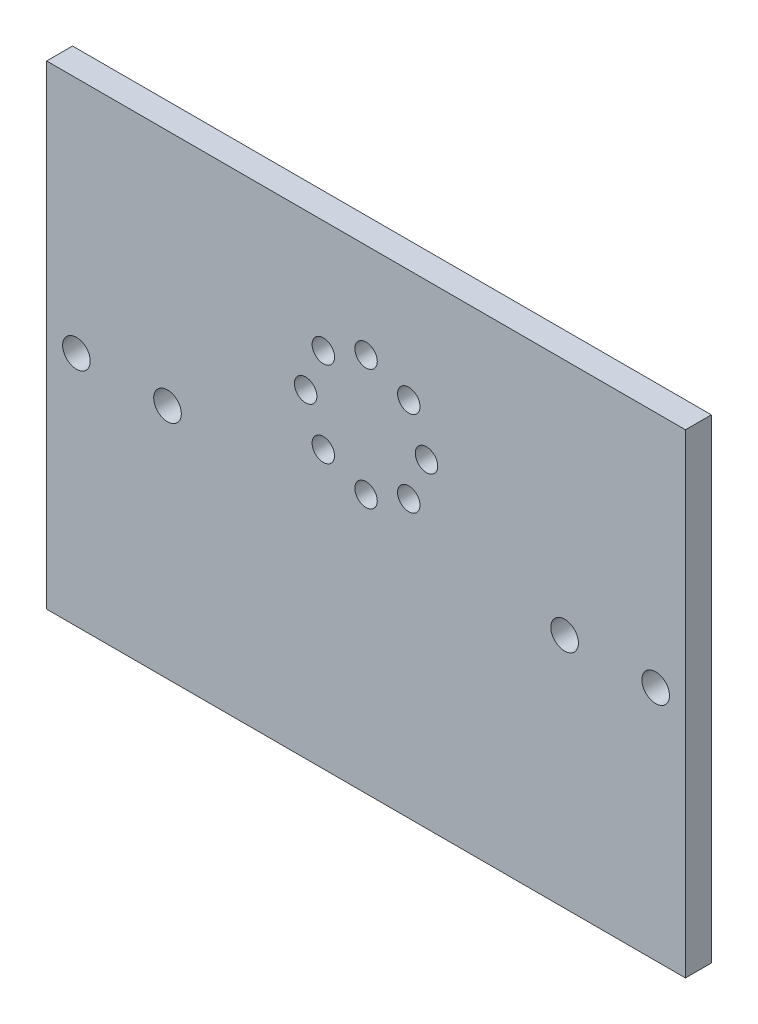
ISO-10303-21;
HEADER;
FILE_DESCRIPTION(('STEP AP214'),'2;1');
FILE_NAME('part.step','',(''),(''),'','','');
FILE_SCHEMA(('AUTOMOTIVE_DESIGN { 1 0 10303 214 1 1 1 1 }'));
ENDSEC;
DATA;
#1=APPLICATION_CONTEXT('core data for automotive mechanical design processes');
#2=APPLICATION_PROTOCOL_DEFINITION('international standard','automotive_design',2000,#1);
#3=PRODUCT_CONTEXT('',#1,'mechanical');
#4=PRODUCT('Part','Part','',(#3));
#5=PRODUCT_RELATED_PRODUCT_CATEGORY('part','',(#4));
#6=PRODUCT_DEFINITION_FORMATION('','',#4);
#7=PRODUCT_DEFINITION_CONTEXT('part definition',#1,'design');
#8=PRODUCT_DEFINITION('design','',#6,#7);
#9=PRODUCT_DEFINITION_SHAPE('','',#8);
#10=(LENGTH_UNIT() NAMED_UNIT(*) SI_UNIT(.MILLI.,.METRE.));
#11=(NAMED_UNIT(*) PLANE_ANGLE_UNIT() SI_UNIT($,.RADIAN.));
#12=(NAMED_UNIT(*) SI_UNIT($,.STERADIAN.) SOLID_ANGLE_UNIT());
#13=UNCERTAINTY_MEASURE_WITH_UNIT(LENGTH_MEASURE(1.E-05),#10,'distance_accuracy_value','');
#14=(GEOMETRIC_REPRESENTATION_CONTEXT(3) GLOBAL_UNCERTAINTY_ASSIGNED_CONTEXT((#13)) GLOBAL_UNIT_ASSIGNED_CONTEXT((#10,
#11,#12)) REPRESENTATION_CONTEXT('',''));
#15=CARTESIAN_POINT('',(0.,0.,0.));
#16=DIRECTION('',(0.,0.,1.));
#17=DIRECTION('',(1.,0.,0.));
#18=AXIS2_PLACEMENT_3D('',#15,#16,#17);
#19=CARTESIAN_POINT('',(37.,27.5,3.));
#20=DIRECTION('',(-1.,0.,0.));
#21=DIRECTION('',(0.,-1.,0.));
#22=AXIS2_PLACEMENT_3D('',#19,#20,#21);
#23=PLANE('',#22);
#24=DIRECTION('',(0.,1.,0.));
#25=VECTOR('',#24,1.);
#26=CARTESIAN_POINT('',(37.,27.5,0.));
#27=LINE('',#26,#25);
#28=CARTESIAN_POINT('',(37.,-27.5,0.));
#29=VERTEX_POINT('',#28);
#30=CARTESIAN_POINT('',(37.,27.5,0.));
#31=VERTEX_POINT('',#30);
#32=EDGE_CURVE('E97',#29,#31,#27,.T.);
#33=ORIENTED_EDGE('',*,*,#32,.T.);
#34=DIRECTION('',(0.,0.,-1.));
#35=VECTOR('',#34,1.);
#36=CARTESIAN_POINT('',(37.,27.5,3.));
#37=LINE('',#36,#35);
#38=CARTESIAN_POINT('',(37.,27.5,3.));
#39=VERTEX_POINT('',#38);
#40=EDGE_CURVE('E11',#39,#31,#37,.T.);
#41=ORIENTED_EDGE('',*,*,#40,.F.);
#42=DIRECTION('',(0.,1.,0.));
#43=VECTOR('',#42,1.);
#44=CARTESIAN_POINT('',(37.,27.5,3.));
#45=LINE('',#44,#43);
#46=CARTESIAN_POINT('',(37.,-27.5,3.));
#47=VERTEX_POINT('',#46);
#48=EDGE_CURVE('E85',#47,#39,#45,.T.);
#49=ORIENTED_EDGE('',*,*,#48,.F.);
#50=DIRECTION('',(0.,0.,-1.));
#51=VECTOR('',#50,1.);
#52=CARTESIAN_POINT('',(37.,-27.5,3.));
#53=LINE('',#52,#51);
#54=EDGE_CURVE('E93',#47,#29,#53,.T.);
#55=ORIENTED_EDGE('',*,*,#54,.T.);
#56=EDGE_LOOP('',(#33,#41,#49,#55));
#57=FACE_BOUND('',#56,.T.);
#58=ADVANCED_FACE('F34',(#57),#23,.F.);
#59=CARTESIAN_POINT('',(-37.,27.5,3.));
#60=DIRECTION('',(0.,-1.,0.));
#61=DIRECTION('',(0.,0.,-1.));
#62=AXIS2_PLACEMENT_3D('',#59,#60,#61);
#63=PLANE('',#62);
#64=DIRECTION('',(-1.,0.,0.));
#65=VECTOR('',#64,1.);
#66=CARTESIAN_POINT('',(-37.,27.5,0.));
#67=LINE('',#66,#65);
#68=CARTESIAN_POINT('',(-37.,27.5,0.));
#69=VERTEX_POINT('',#68);
#70=EDGE_CURVE('E89',#31,#69,#67,.T.);
#71=ORIENTED_EDGE('',*,*,#70,.T.);
#72=DIRECTION('',(0.,0.,-1.));
#73=VECTOR('',#72,1.);
#74=CARTESIAN_POINT('',(-37.,27.5,3.));
#75=LINE('',#74,#73);
#76=CARTESIAN_POINT('',(-37.,27.5,3.));
#77=VERTEX_POINT('',#76);
#78=EDGE_CURVE('E42',#77,#69,#75,.T.);
#79=ORIENTED_EDGE('',*,*,#78,.F.);
#80=DIRECTION('',(-1.,0.,0.));
#81=VECTOR('',#80,1.);
#82=CARTESIAN_POINT('',(-37.,27.5,3.));
#83=LINE('',#82,#81);
#84=EDGE_CURVE('E80',#39,#77,#83,.T.);
#85=ORIENTED_EDGE('',*,*,#84,.F.);
#86=ORIENTED_EDGE('',*,*,#40,.T.);
#87=EDGE_LOOP('',(#71,#79,#85,#86));
#88=FACE_BOUND('',#87,.T.);
#89=ADVANCED_FACE('F88',(#88),#63,.F.);
#90=CARTESIAN_POINT('',(-37.,27.5,3.));
#91=DIRECTION('',(1.,0.,0.));
#92=DIRECTION('',(0.,1.,0.));
#93=AXIS2_PLACEMENT_3D('',#90,#91,#92);
#94=PLANE('',#93);
#95=DIRECTION('',(0.,-1.,0.));
#96=VECTOR('',#95,1.);
#97=CARTESIAN_POINT('',(-37.,27.5,0.));
#98=LINE('',#97,#96);
#99=CARTESIAN_POINT('',(-37.,-27.5,0.));
#100=VERTEX_POINT('',#99);
#101=EDGE_CURVE('E67',#69,#100,#98,.T.);
#102=ORIENTED_EDGE('',*,*,#101,.T.);
#103=DIRECTION('',(0.,0.,-1.));
#104=VECTOR('',#103,1.);
#105=CARTESIAN_POINT('',(-37.,-27.5,3.));
#106=LINE('',#105,#104);
#107=CARTESIAN_POINT('',(-37.,-27.5,3.));
#108=VERTEX_POINT('',#107);
#109=EDGE_CURVE('E90',#108,#100,#106,.T.);
#110=ORIENTED_EDGE('',*,*,#109,.F.);
#111=DIRECTION('',(0.,-1.,0.));
#112=VECTOR('',#111,1.);
#113=CARTESIAN_POINT('',(-37.,27.5,3.));
#114=LINE('',#113,#112);
#115=EDGE_CURVE('E83',#77,#108,#114,.T.);
#116=ORIENTED_EDGE('',*,*,#115,.F.);
#117=ORIENTED_EDGE('',*,*,#78,.T.);
#118=EDGE_LOOP('',(#102,#110,#116,#117));
#119=FACE_BOUND('',#118,.T.);
#120=ADVANCED_FACE('F91',(#119),#94,.F.);
#121=CARTESIAN_POINT('',(-37.,-27.5,3.));
#122=DIRECTION('',(0.,1.,0.));
#123=DIRECTION('',(0.,0.,1.));
#124=AXIS2_PLACEMENT_3D('',#121,#122,#123);
#125=PLANE('',#124);
#126=DIRECTION('',(1.,0.,0.));
#127=VECTOR('',#126,1.);
#128=CARTESIAN_POINT('',(-37.,-27.5,0.));
#129=LINE('',#128,#127);
#130=EDGE_CURVE('E73',#100,#29,#129,.T.);
#131=ORIENTED_EDGE('',*,*,#130,.T.);
#132=ORIENTED_EDGE('',*,*,#54,.F.);
#133=DIRECTION('',(1.,0.,0.));
#134=VECTOR('',#133,1.);
#135=CARTESIAN_POINT('',(-37.,-27.5,3.));
#136=LINE('',#135,#134);
#137=EDGE_CURVE('E50',#108,#47,#136,.T.);
#138=ORIENTED_EDGE('',*,*,#137,.F.);
#139=ORIENTED_EDGE('',*,*,#109,.T.);
#140=EDGE_LOOP('',(#131,#132,#138,#139));
#141=FACE_BOUND('',#140,.T.);
#142=ADVANCED_FACE('F105',(#141),#125,.F.);
#143=CARTESIAN_POINT('',(0.,0.,3.));
#144=DIRECTION('',(0.,0.,1.));
#145=DIRECTION('',(1.,0.,0.));
#146=AXIS2_PLACEMENT_3D('',#143,#144,#145);
#147=PLANE('',#146);
#148=CARTESIAN_POINT('',(4.94974746830583,4.55025253169417,3.));
#149=DIRECTION('',(0.,0.,1.));
#150=DIRECTION('',(1.,0.,0.));
#151=AXIS2_PLACEMENT_3D('',#148,#149,#150);
#152=CIRCLE('',#151,1.3);
#153=CARTESIAN_POINT('',(6.24974746830583,4.55025253169417,3.));
#154=VERTEX_POINT('',#153);
#155=EDGE_CURVE('E138',#154,#154,#152,.T.);
#156=ORIENTED_EDGE('',*,*,#155,.F.);
#157=EDGE_LOOP('',(#156));
#158=FACE_BOUND('',#157,.T.);
#159=CARTESIAN_POINT('',(6.99999999999999,9.50000000000001,3.));
#160=DIRECTION('',(0.,0.,1.));
#161=DIRECTION('',(1.,0.,0.));
#162=AXIS2_PLACEMENT_3D('',#159,#160,#161);
#163=CIRCLE('',#162,1.3);
#164=CARTESIAN_POINT('',(8.29999999999999,9.50000000000001,3.));
#165=VERTEX_POINT('',#164);
#166=EDGE_CURVE('E157',#165,#165,#163,.T.);
#167=ORIENTED_EDGE('',*,*,#166,.F.);
#168=EDGE_LOOP('',(#167));
#169=FACE_BOUND('',#168,.T.);
#170=CARTESIAN_POINT('',(4.94974746830581,14.4497474683058,3.));
#171=DIRECTION('',(0.,0.,1.));
#172=DIRECTION('',(1.,0.,0.));
#173=AXIS2_PLACEMENT_3D('',#170,#171,#172);
#174=CIRCLE('',#173,1.3);
#175=CARTESIAN_POINT('',(6.24974746830581,14.4497474683058,3.));
#176=VERTEX_POINT('',#175);
#177=EDGE_CURVE('E151',#176,#176,#174,.T.);
#178=ORIENTED_EDGE('',*,*,#177,.F.);
#179=EDGE_LOOP('',(#178));
#180=FACE_BOUND('',#179,.T.);
#181=CARTESIAN_POINT('',(-4.94974746830586,14.4497474683058,3.));
#182=DIRECTION('',(0.,0.,1.));
#183=DIRECTION('',(1.,0.,0.));
#184=AXIS2_PLACEMENT_3D('',#181,#182,#183);
#185=CIRCLE('',#184,1.3);
#186=CARTESIAN_POINT('',(-3.64974746830586,14.4497474683058,3.));
#187=VERTEX_POINT('',#186);
#188=EDGE_CURVE('E144',#187,#187,#185,.T.);
#189=ORIENTED_EDGE('',*,*,#188,.F.);
#190=EDGE_LOOP('',(#189));
#191=FACE_BOUND('',#190,.T.);
#192=CARTESIAN_POINT('',(-7.00000000000001,9.49999999999998,3.));
#193=DIRECTION('',(0.,0.,1.));
#194=DIRECTION('',(1.,0.,0.));
#195=AXIS2_PLACEMENT_3D('',#192,#193,#194);
#196=CIRCLE('',#195,1.3);
#197=CARTESIAN_POINT('',(-5.70000000000001,9.49999999999998,3.));
#198=VERTEX_POINT('',#197);
#199=EDGE_CURVE('E145',#198,#198,#196,.T.);
#200=ORIENTED_EDGE('',*,*,#199,.F.);
#201=EDGE_LOOP('',(#200));
#202=FACE_BOUND('',#201,.T.);
#203=CARTESIAN_POINT('',(-4.94974746830584,4.55025253169415,3.));
#204=DIRECTION('',(0.,0.,1.));
#205=DIRECTION('',(1.,0.,0.));
#206=AXIS2_PLACEMENT_3D('',#203,#204,#205);
#207=CIRCLE('',#206,1.3);
#208=CARTESIAN_POINT('',(-3.64974746830584,4.55025253169415,3.));
#209=VERTEX_POINT('',#208);
#210=EDGE_CURVE('E174',#209,#209,#207,.T.);
#211=ORIENTED_EDGE('',*,*,#210,.F.);
#212=EDGE_LOOP('',(#211));
#213=FACE_BOUND('',#212,.T.);
#214=CARTESIAN_POINT('',(0.,16.5,3.));
#215=DIRECTION('',(0.,0.,1.));
#216=DIRECTION('',(1.,0.,0.));
#217=AXIS2_PLACEMENT_3D('',#214,#215,#216);
#218=CIRCLE('',#217,1.3);
#219=CARTESIAN_POINT('',(1.29999999999997,16.5,3.));
#220=VERTEX_POINT('',#219);
#221=EDGE_CURVE('E168',#220,#220,#218,.T.);
#222=ORIENTED_EDGE('',*,*,#221,.F.);
#223=EDGE_LOOP('',(#222));
#224=FACE_BOUND('',#223,.T.);
#225=CARTESIAN_POINT('',(0.,2.49999999999999,3.));
#226=DIRECTION('',(0.,0.,1.));
#227=DIRECTION('',(1.,0.,0.));
#228=AXIS2_PLACEMENT_3D('',#225,#226,#227);
#229=CIRCLE('',#228,1.3);
#230=CARTESIAN_POINT('',(1.3,2.49999999999999,3.));
#231=VERTEX_POINT('',#230);
#232=EDGE_CURVE('E135',#231,#231,#229,.T.);
#233=ORIENTED_EDGE('',*,*,#232,.F.);
#234=EDGE_LOOP('',(#233));
#235=FACE_BOUND('',#234,.T.);
#236=CARTESIAN_POINT('',(-33.55,-0.0999999999999959,3.));
#237=DIRECTION('',(0.,0.,1.));
#238=DIRECTION('',(1.,0.,0.));
#239=AXIS2_PLACEMENT_3D('',#236,#237,#238);
#240=CIRCLE('',#239,1.60000000000001);
#241=CARTESIAN_POINT('',(-31.95,-0.0999999999999959,3.));
#242=VERTEX_POINT('',#241);
#243=EDGE_CURVE('E130',#242,#242,#240,.T.);
#244=ORIENTED_EDGE('',*,*,#243,.F.);
#245=EDGE_LOOP('',(#244));
#246=FACE_BOUND('',#245,.T.);
#247=CARTESIAN_POINT('',(-23.,-0.0999999999999925,3.));
#248=DIRECTION('',(0.,0.,1.));
#249=DIRECTION('',(1.,0.,0.));
#250=AXIS2_PLACEMENT_3D('',#247,#248,#249);
#251=CIRCLE('',#250,1.6);
#252=CARTESIAN_POINT('',(-21.4,-0.0999999999999925,3.));
#253=VERTEX_POINT('',#252);
#254=EDGE_CURVE('E127',#253,#253,#251,.T.);
#255=ORIENTED_EDGE('',*,*,#254,.F.);
#256=EDGE_LOOP('',(#255));
#257=FACE_BOUND('',#256,.T.);
#258=CARTESIAN_POINT('',(23.,-0.0999999999999925,3.));
#259=DIRECTION('',(0.,0.,1.));
#260=DIRECTION('',(1.,0.,0.));
#261=AXIS2_PLACEMENT_3D('',#258,#259,#260);
#262=CIRCLE('',#261,1.6);
#263=CARTESIAN_POINT('',(24.6,-0.0999999999999925,3.));
#264=VERTEX_POINT('',#263);
#265=EDGE_CURVE('E121',#264,#264,#262,.T.);
#266=ORIENTED_EDGE('',*,*,#265,.F.);
#267=EDGE_LOOP('',(#266));
#268=FACE_BOUND('',#267,.T.);
#269=CARTESIAN_POINT('',(33.55,-0.0999999999999873,3.));
#270=DIRECTION('',(0.,0.,1.));
#271=DIRECTION('',(1.,0.,0.));
#272=AXIS2_PLACEMENT_3D('',#269,#270,#271);
#273=CIRCLE('',#272,1.6);
#274=CARTESIAN_POINT('',(35.15,-0.0999999999999873,3.));
#275=VERTEX_POINT('',#274);
#276=EDGE_CURVE('E114',#275,#275,#273,.T.);
#277=ORIENTED_EDGE('',*,*,#276,.F.);
#278=EDGE_LOOP('',(#277));
#279=FACE_BOUND('',#278,.T.);
#280=ORIENTED_EDGE('',*,*,#48,.T.);
#281=ORIENTED_EDGE('',*,*,#84,.T.);
#282=ORIENTED_EDGE('',*,*,#115,.T.);
#283=ORIENTED_EDGE('',*,*,#137,.T.);
#284=EDGE_LOOP('',(#280,#281,#282,#283));
#285=FACE_BOUND('',#284,.T.);
#286=ADVANCED_FACE('F81',(#158,#169,#180,#191,#202,#213,#224,#235,#246,#257,#268,#279,#285),
#147,.T.);
#287=CARTESIAN_POINT('',(0.,0.,0.));
#288=DIRECTION('',(0.,0.,1.));
#289=DIRECTION('',(1.,0.,0.));
#290=AXIS2_PLACEMENT_3D('',#287,#288,#289);
#291=PLANE('',#290);
#292=CARTESIAN_POINT('',(4.94974746830583,4.55025253169417,0.));
#293=DIRECTION('',(0.,0.,1.));
#294=DIRECTION('',(1.,0.,0.));
#295=AXIS2_PLACEMENT_3D('',#292,#293,#294);
#296=CIRCLE('',#295,1.3);
#297=CARTESIAN_POINT('',(6.24974746830583,4.55025253169417,0.));
#298=VERTEX_POINT('',#297);
#299=EDGE_CURVE('E160',#298,#298,#296,.T.);
#300=ORIENTED_EDGE('',*,*,#299,.T.);
#301=EDGE_LOOP('',(#300));
#302=FACE_BOUND('',#301,.T.);
#303=CARTESIAN_POINT('',(6.99999999999999,9.50000000000001,0.));
#304=DIRECTION('',(0.,0.,1.));
#305=DIRECTION('',(1.,0.,0.));
#306=AXIS2_PLACEMENT_3D('',#303,#304,#305);
#307=CIRCLE('',#306,1.3);
#308=CARTESIAN_POINT('',(8.29999999999999,9.50000000000001,0.));
#309=VERTEX_POINT('',#308);
#310=EDGE_CURVE('E154',#309,#309,#307,.T.);
#311=ORIENTED_EDGE('',*,*,#310,.T.);
#312=EDGE_LOOP('',(#311));
#313=FACE_BOUND('',#312,.T.);
#314=CARTESIAN_POINT('',(4.94974746830581,14.4497474683058,0.));
#315=DIRECTION('',(0.,0.,1.));
#316=DIRECTION('',(1.,0.,0.));
#317=AXIS2_PLACEMENT_3D('',#314,#315,#316);
#318=CIRCLE('',#317,1.3);
#319=CARTESIAN_POINT('',(6.24974746830581,14.4497474683058,0.));
#320=VERTEX_POINT('',#319);
#321=EDGE_CURVE('E148',#320,#320,#318,.T.);
#322=ORIENTED_EDGE('',*,*,#321,.T.);
#323=EDGE_LOOP('',(#322));
#324=FACE_BOUND('',#323,.T.);
#325=CARTESIAN_POINT('',(-4.94974746830586,14.4497474683058,0.));
#326=DIRECTION('',(0.,0.,1.));
#327=DIRECTION('',(1.,0.,0.));
#328=AXIS2_PLACEMENT_3D('',#325,#326,#327);
#329=CIRCLE('',#328,1.3);
#330=CARTESIAN_POINT('',(-3.64974746830586,14.4497474683058,0.));
#331=VERTEX_POINT('',#330);
#332=EDGE_CURVE('E141',#331,#331,#329,.T.);
#333=ORIENTED_EDGE('',*,*,#332,.T.);
#334=EDGE_LOOP('',(#333));
#335=FACE_BOUND('',#334,.T.);
#336=CARTESIAN_POINT('',(-7.00000000000001,9.49999999999998,0.));
#337=DIRECTION('',(0.,0.,1.));
#338=DIRECTION('',(1.,0.,0.));
#339=AXIS2_PLACEMENT_3D('',#336,#337,#338);
#340=CIRCLE('',#339,1.3);
#341=CARTESIAN_POINT('',(-5.70000000000001,9.49999999999998,0.));
#342=VERTEX_POINT('',#341);
#343=EDGE_CURVE('E177',#342,#342,#340,.T.);
#344=ORIENTED_EDGE('',*,*,#343,.T.);
#345=EDGE_LOOP('',(#344));
#346=FACE_BOUND('',#345,.T.);
#347=CARTESIAN_POINT('',(-4.94974746830584,4.55025253169415,0.));
#348=DIRECTION('',(0.,0.,1.));
#349=DIRECTION('',(1.,0.,0.));
#350=AXIS2_PLACEMENT_3D('',#347,#348,#349);
#351=CIRCLE('',#350,1.3);
#352=CARTESIAN_POINT('',(-3.64974746830584,4.55025253169415,0.));
#353=VERTEX_POINT('',#352);
#354=EDGE_CURVE('E171',#353,#353,#351,.T.);
#355=ORIENTED_EDGE('',*,*,#354,.T.);
#356=EDGE_LOOP('',(#355));
#357=FACE_BOUND('',#356,.T.);
#358=CARTESIAN_POINT('',(0.,16.5,0.));
#359=DIRECTION('',(0.,0.,1.));
#360=DIRECTION('',(1.,0.,0.));
#361=AXIS2_PLACEMENT_3D('',#358,#359,#360);
#362=CIRCLE('',#361,1.3);
#363=CARTESIAN_POINT('',(1.29999999999997,16.5,0.));
#364=VERTEX_POINT('',#363);
#365=EDGE_CURVE('E165',#364,#364,#362,.T.);
#366=ORIENTED_EDGE('',*,*,#365,.T.);
#367=EDGE_LOOP('',(#366));
#368=FACE_BOUND('',#367,.T.);
#369=CARTESIAN_POINT('',(0.,2.49999999999999,0.));
#370=DIRECTION('',(0.,0.,1.));
#371=DIRECTION('',(1.,0.,0.));
#372=AXIS2_PLACEMENT_3D('',#369,#370,#371);
#373=CIRCLE('',#372,1.3);
#374=CARTESIAN_POINT('',(1.3,2.49999999999999,0.));
#375=VERTEX_POINT('',#374);
#376=EDGE_CURVE('E115',#375,#375,#373,.T.);
#377=ORIENTED_EDGE('',*,*,#376,.T.);
#378=EDGE_LOOP('',(#377));
#379=FACE_BOUND('',#378,.T.);
#380=CARTESIAN_POINT('',(-33.55,-0.0999999999999959,0.));
#381=DIRECTION('',(0.,0.,1.));
#382=DIRECTION('',(1.,0.,0.));
#383=AXIS2_PLACEMENT_3D('',#380,#381,#382);
#384=CIRCLE('',#383,1.60000000000001);
#385=CARTESIAN_POINT('',(-31.95,-0.0999999999999959,0.));
#386=VERTEX_POINT('',#385);
#387=EDGE_CURVE('E100',#386,#386,#384,.T.);
#388=ORIENTED_EDGE('',*,*,#387,.T.);
#389=EDGE_LOOP('',(#388));
#390=FACE_BOUND('',#389,.T.);
#391=CARTESIAN_POINT('',(-23.,-0.0999999999999925,0.));
#392=DIRECTION('',(0.,0.,1.));
#393=DIRECTION('',(1.,0.,0.));
#394=AXIS2_PLACEMENT_3D('',#391,#392,#393);
#395=CIRCLE('',#394,1.6);
#396=CARTESIAN_POINT('',(-21.4,-0.0999999999999925,0.));
#397=VERTEX_POINT('',#396);
#398=EDGE_CURVE('E124',#397,#397,#395,.T.);
#399=ORIENTED_EDGE('',*,*,#398,.T.);
#400=EDGE_LOOP('',(#399));
#401=FACE_BOUND('',#400,.T.);
#402=CARTESIAN_POINT('',(23.,-0.0999999999999925,0.));
#403=DIRECTION('',(0.,0.,1.));
#404=DIRECTION('',(1.,0.,0.));
#405=AXIS2_PLACEMENT_3D('',#402,#403,#404);
#406=CIRCLE('',#405,1.6);
#407=CARTESIAN_POINT('',(24.6,-0.0999999999999925,0.));
#408=VERTEX_POINT('',#407);
#409=EDGE_CURVE('E118',#408,#408,#406,.T.);
#410=ORIENTED_EDGE('',*,*,#409,.T.);
#411=EDGE_LOOP('',(#410));
#412=FACE_BOUND('',#411,.T.);
#413=CARTESIAN_POINT('',(33.55,-0.0999999999999873,0.));
#414=DIRECTION('',(0.,0.,1.));
#415=DIRECTION('',(1.,0.,0.));
#416=AXIS2_PLACEMENT_3D('',#413,#414,#415);
#417=CIRCLE('',#416,1.6);
#418=CARTESIAN_POINT('',(35.15,-0.0999999999999873,0.));
#419=VERTEX_POINT('',#418);
#420=EDGE_CURVE('E111',#419,#419,#417,.T.);
#421=ORIENTED_EDGE('',*,*,#420,.T.);
#422=EDGE_LOOP('',(#421));
#423=FACE_BOUND('',#422,.T.);
#424=ORIENTED_EDGE('',*,*,#32,.F.);
#425=ORIENTED_EDGE('',*,*,#130,.F.);
#426=ORIENTED_EDGE('',*,*,#101,.F.);
#427=ORIENTED_EDGE('',*,*,#70,.F.);
#428=EDGE_LOOP('',(#424,#425,#426,#427));
#429=FACE_BOUND('',#428,.T.);
#430=ADVANCED_FACE('F108',(#302,#313,#324,#335,#346,#357,#368,#379,#390,#401,#412,#423,#429),
#291,.F.);
#431=CARTESIAN_POINT('',(33.55,-0.0999999999999873,0.));
#432=DIRECTION('',(0.,0.,1.));
#433=DIRECTION('',(1.,0.,0.));
#434=AXIS2_PLACEMENT_3D('',#431,#432,#433);
#435=CYLINDRICAL_SURFACE('',#434,1.6);
#436=ORIENTED_EDGE('',*,*,#420,.F.);
#437=EDGE_LOOP('',(#436));
#438=FACE_BOUND('',#437,.T.);
#439=ORIENTED_EDGE('',*,*,#276,.T.);
#440=EDGE_LOOP('',(#439));
#441=FACE_BOUND('',#440,.T.);
#442=ADVANCED_FACE('F203',(#438,#441),#435,.F.);
#443=CARTESIAN_POINT('',(23.,-0.0999999999999925,0.));
#444=DIRECTION('',(0.,0.,1.));
#445=DIRECTION('',(1.,0.,0.));
#446=AXIS2_PLACEMENT_3D('',#443,#444,#445);
#447=CYLINDRICAL_SURFACE('',#446,1.6);
#448=ORIENTED_EDGE('',*,*,#409,.F.);
#449=EDGE_LOOP('',(#448));
#450=FACE_BOUND('',#449,.T.);
#451=ORIENTED_EDGE('',*,*,#265,.T.);
#452=EDGE_LOOP('',(#451));
#453=FACE_BOUND('',#452,.T.);
#454=ADVANCED_FACE('F205',(#450,#453),#447,.F.);
#455=CARTESIAN_POINT('',(-23.,-0.0999999999999925,0.));
#456=DIRECTION('',(0.,0.,1.));
#457=DIRECTION('',(1.,0.,0.));
#458=AXIS2_PLACEMENT_3D('',#455,#456,#457);
#459=CYLINDRICAL_SURFACE('',#458,1.6);
#460=ORIENTED_EDGE('',*,*,#398,.F.);
#461=EDGE_LOOP('',(#460));
#462=FACE_BOUND('',#461,.T.);
#463=ORIENTED_EDGE('',*,*,#254,.T.);
#464=EDGE_LOOP('',(#463));
#465=FACE_BOUND('',#464,.T.);
#466=ADVANCED_FACE('F212',(#462,#465),#459,.F.);
#467=CARTESIAN_POINT('',(-33.55,-0.0999999999999959,0.));
#468=DIRECTION('',(0.,0.,1.));
#469=DIRECTION('',(1.,0.,0.));
#470=AXIS2_PLACEMENT_3D('',#467,#468,#469);
#471=CYLINDRICAL_SURFACE('',#470,1.60000000000001);
#472=ORIENTED_EDGE('',*,*,#387,.F.);
#473=EDGE_LOOP('',(#472));
#474=FACE_BOUND('',#473,.T.);
#475=ORIENTED_EDGE('',*,*,#243,.T.);
#476=EDGE_LOOP('',(#475));
#477=FACE_BOUND('',#476,.T.);
#478=ADVANCED_FACE('F253',(#474,#477),#471,.F.);
#479=CARTESIAN_POINT('',(0.,2.49999999999999,0.));
#480=DIRECTION('',(0.,0.,1.));
#481=DIRECTION('',(1.,0.,0.));
#482=AXIS2_PLACEMENT_3D('',#479,#480,#481);
#483=CYLINDRICAL_SURFACE('',#482,1.3);
#484=ORIENTED_EDGE('',*,*,#376,.F.);
#485=EDGE_LOOP('',(#484));
#486=FACE_BOUND('',#485,.T.);
#487=ORIENTED_EDGE('',*,*,#232,.T.);
#488=EDGE_LOOP('',(#487));
#489=FACE_BOUND('',#488,.T.);
#490=ADVANCED_FACE('F247',(#486,#489),#483,.F.);
#491=CARTESIAN_POINT('',(0.,16.5,0.));
#492=DIRECTION('',(0.,0.,1.));
#493=DIRECTION('',(1.,0.,0.));
#494=AXIS2_PLACEMENT_3D('',#491,#492,#493);
#495=CYLINDRICAL_SURFACE('',#494,1.3);
#496=ORIENTED_EDGE('',*,*,#365,.F.);
#497=EDGE_LOOP('',(#496));
#498=FACE_BOUND('',#497,.T.);
#499=ORIENTED_EDGE('',*,*,#221,.T.);
#500=EDGE_LOOP('',(#499));
#501=FACE_BOUND('',#500,.T.);
#502=ADVANCED_FACE('F252',(#498,#501),#495,.F.);
#503=CARTESIAN_POINT('',(-4.94974746830584,4.55025253169415,0.));
#504=DIRECTION('',(0.,0.,1.));
#505=DIRECTION('',(1.,0.,0.));
#506=AXIS2_PLACEMENT_3D('',#503,#504,#505);
#507=CYLINDRICAL_SURFACE('',#506,1.3);
#508=ORIENTED_EDGE('',*,*,#354,.F.);
#509=EDGE_LOOP('',(#508));
#510=FACE_BOUND('',#509,.T.);
#511=ORIENTED_EDGE('',*,*,#210,.T.);
#512=EDGE_LOOP('',(#511));
#513=FACE_BOUND('',#512,.T.);
#514=ADVANCED_FACE('F265',(#510,#513),#507,.F.);
#515=CARTESIAN_POINT('',(-7.00000000000001,9.49999999999998,0.));
#516=DIRECTION('',(0.,0.,1.));
#517=DIRECTION('',(1.,0.,0.));
#518=AXIS2_PLACEMENT_3D('',#515,#516,#517);
#519=CYLINDRICAL_SURFACE('',#518,1.3);
#520=ORIENTED_EDGE('',*,*,#343,.F.);
#521=EDGE_LOOP('',(#520));
#522=FACE_BOUND('',#521,.T.);
#523=ORIENTED_EDGE('',*,*,#199,.T.);
#524=EDGE_LOOP('',(#523));
#525=FACE_BOUND('',#524,.T.);
#526=ADVANCED_FACE('F183',(#522,#525),#519,.F.);
#527=CARTESIAN_POINT('',(-4.94974746830586,14.4497474683058,0.));
#528=DIRECTION('',(0.,0.,1.));
#529=DIRECTION('',(1.,0.,0.));
#530=AXIS2_PLACEMENT_3D('',#527,#528,#529);
#531=CYLINDRICAL_SURFACE('',#530,1.3);
#532=ORIENTED_EDGE('',*,*,#332,.F.);
#533=EDGE_LOOP('',(#532));
#534=FACE_BOUND('',#533,.T.);
#535=ORIENTED_EDGE('',*,*,#188,.T.);
#536=EDGE_LOOP('',(#535));
#537=FACE_BOUND('',#536,.T.);
#538=ADVANCED_FACE('F284',(#534,#537),#531,.F.);
#539=CARTESIAN_POINT('',(4.94974746830581,14.4497474683058,0.));
#540=DIRECTION('',(0.,0.,1.));
#541=DIRECTION('',(1.,0.,0.));
#542=AXIS2_PLACEMENT_3D('',#539,#540,#541);
#543=CYLINDRICAL_SURFACE('',#542,1.3);
#544=ORIENTED_EDGE('',*,*,#321,.F.);
#545=EDGE_LOOP('',(#544));
#546=FACE_BOUND('',#545,.T.);
#547=ORIENTED_EDGE('',*,*,#177,.T.);
#548=EDGE_LOOP('',(#547));
#549=FACE_BOUND('',#548,.T.);
#550=ADVANCED_FACE('F294',(#546,#549),#543,.F.);
#551=CARTESIAN_POINT('',(6.99999999999999,9.50000000000001,0.));
#552=DIRECTION('',(0.,0.,1.));
#553=DIRECTION('',(1.,0.,0.));
#554=AXIS2_PLACEMENT_3D('',#551,#552,#553);
#555=CYLINDRICAL_SURFACE('',#554,1.3);
#556=ORIENTED_EDGE('',*,*,#310,.F.);
#557=EDGE_LOOP('',(#556));
#558=FACE_BOUND('',#557,.T.);
#559=ORIENTED_EDGE('',*,*,#166,.T.);
#560=EDGE_LOOP('',(#559));
#561=FACE_BOUND('',#560,.T.);
#562=ADVANCED_FACE('F304',(#558,#561),#555,.F.);
#563=CARTESIAN_POINT('',(4.94974746830583,4.55025253169417,0.));
#564=DIRECTION('',(0.,0.,1.));
#565=DIRECTION('',(1.,0.,0.));
#566=AXIS2_PLACEMENT_3D('',#563,#564,#565);
#567=CYLINDRICAL_SURFACE('',#566,1.3);
#568=ORIENTED_EDGE('',*,*,#299,.F.);
#569=EDGE_LOOP('',(#568));
#570=FACE_BOUND('',#569,.T.);
#571=ORIENTED_EDGE('',*,*,#155,.T.);
#572=EDGE_LOOP('',(#571));
#573=FACE_BOUND('',#572,.T.);
#574=ADVANCED_FACE('F314',(#570,#573),#567,.F.);
#575=CLOSED_SHELL('',(#58,#89,#120,#142,#286,#430,#442,#454,#466,#478,#490,#502,#514,#526,#538,
#550,#562,#574));
#576=MANIFOLD_SOLID_BREP('B2',#575);
#577=ADVANCED_BREP_SHAPE_REPRESENTATION('',(#18,#576),#14);
#578=SHAPE_DEFINITION_REPRESENTATION(#9,#577);
ENDSEC;
END-ISO-10303-21;
